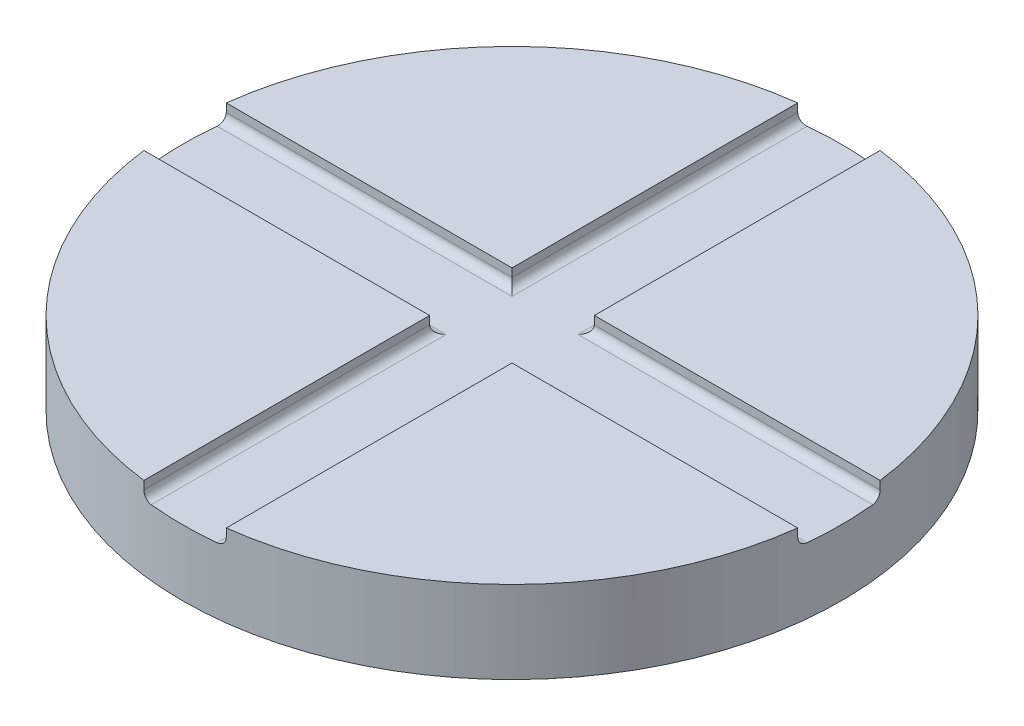
ISO-10303-21;
HEADER;
FILE_DESCRIPTION(('STEP AP214'),'2;1');
FILE_NAME('part.step','',(''),(''),'','','');
FILE_SCHEMA(('AUTOMOTIVE_DESIGN { 1 0 10303 214 1 1 1 1 }'));
ENDSEC;
DATA;
#1=APPLICATION_CONTEXT('core data for automotive mechanical design processes');
#2=APPLICATION_PROTOCOL_DEFINITION('international standard','automotive_design',2000,#1);
#3=PRODUCT_CONTEXT('',#1,'mechanical');
#4=PRODUCT('Part','Part','',(#3));
#5=PRODUCT_RELATED_PRODUCT_CATEGORY('part','',(#4));
#6=PRODUCT_DEFINITION_FORMATION('','',#4);
#7=PRODUCT_DEFINITION_CONTEXT('part definition',#1,'design');
#8=PRODUCT_DEFINITION('design','',#6,#7);
#9=PRODUCT_DEFINITION_SHAPE('','',#8);
#10=(LENGTH_UNIT() NAMED_UNIT(*) SI_UNIT(.MILLI.,.METRE.));
#11=(NAMED_UNIT(*) PLANE_ANGLE_UNIT() SI_UNIT($,.RADIAN.));
#12=(NAMED_UNIT(*) SI_UNIT($,.STERADIAN.) SOLID_ANGLE_UNIT());
#13=UNCERTAINTY_MEASURE_WITH_UNIT(LENGTH_MEASURE(1.E-05),#10,'distance_accuracy_value','');
#14=(GEOMETRIC_REPRESENTATION_CONTEXT(3) GLOBAL_UNCERTAINTY_ASSIGNED_CONTEXT((#13)) GLOBAL_UNIT_ASSIGNED_CONTEXT((#10,
#11,#12)) REPRESENTATION_CONTEXT('',''));
#15=CARTESIAN_POINT('',(0.,0.,0.));
#16=DIRECTION('',(0.,0.,1.));
#17=DIRECTION('',(1.,0.,0.));
#18=AXIS2_PLACEMENT_3D('',#15,#16,#17);
#19=CARTESIAN_POINT('',(0.,10.,0.));
#20=DIRECTION('',(0.,1.,0.));
#21=DIRECTION('',(0.,0.,1.));
#22=AXIS2_PLACEMENT_3D('',#19,#20,#21);
#23=PLANE('',#22);
#24=DIRECTION('',(0.,0.,-1.));
#25=VECTOR('',#24,1.);
#26=CARTESIAN_POINT('',(5.,10.,-4.99999999999998));
#27=LINE('',#26,#25);
#28=CARTESIAN_POINT('',(5.,10.,-4.99999999999998));
#29=VERTEX_POINT('',#28);
#30=CARTESIAN_POINT('',(4.99999999999999,10.,-39.6862696659689));
#31=VERTEX_POINT('',#30);
#32=EDGE_CURVE('E206',#29,#31,#27,.T.);
#33=ORIENTED_EDGE('',*,*,#32,.F.);
#34=DIRECTION('',(-1.,0.,0.));
#35=VECTOR('',#34,1.);
#36=CARTESIAN_POINT('',(39.6862696659689,10.,-4.99999999999987));
#37=LINE('',#36,#35);
#38=CARTESIAN_POINT('',(39.6862696659689,10.,-4.99999999999987));
#39=VERTEX_POINT('',#38);
#40=EDGE_CURVE('E203',#39,#29,#37,.T.);
#41=ORIENTED_EDGE('',*,*,#40,.F.);
#42=CARTESIAN_POINT('',(0.,10.,0.));
#43=DIRECTION('',(0.,1.,0.));
#44=DIRECTION('',(0.,0.,1.));
#45=AXIS2_PLACEMENT_3D('',#42,#43,#44);
#46=CIRCLE('',#45,40.);
#47=EDGE_CURVE('E236',#39,#31,#46,.T.);
#48=ORIENTED_EDGE('',*,*,#47,.T.);
#49=EDGE_LOOP('',(#33,#41,#48));
#50=FACE_BOUND('',#49,.T.);
#51=ADVANCED_FACE('F36',(#50),#23,.T.);
#52=DIRECTION('',(1.,0.,0.));
#53=VECTOR('',#52,1.);
#54=CARTESIAN_POINT('',(39.6862696659688,10.,5.00000000000014));
#55=LINE('',#54,#53);
#56=CARTESIAN_POINT('',(5.,10.,5.00000000000002));
#57=VERTEX_POINT('',#56);
#58=CARTESIAN_POINT('',(39.6862696659688,10.,5.00000000000014));
#59=VERTEX_POINT('',#58);
#60=EDGE_CURVE('E200',#57,#59,#55,.T.);
#61=ORIENTED_EDGE('',*,*,#60,.F.);
#62=DIRECTION('',(0.,0.,-1.));
#63=VECTOR('',#62,1.);
#64=CARTESIAN_POINT('',(5.00000000000001,10.,39.6862696659689));
#65=LINE('',#64,#63);
#66=CARTESIAN_POINT('',(5.,10.,39.6862696659689));
#67=VERTEX_POINT('',#66);
#68=EDGE_CURVE('E197',#67,#57,#65,.T.);
#69=ORIENTED_EDGE('',*,*,#68,.F.);
#70=EDGE_CURVE('E232',#67,#59,#46,.T.);
#71=ORIENTED_EDGE('',*,*,#70,.T.);
#72=EDGE_LOOP('',(#61,#69,#71));
#73=FACE_BOUND('',#72,.T.);
#74=ADVANCED_FACE('F404',(#73),#23,.T.);
#75=DIRECTION('',(0.,0.,1.));
#76=VECTOR('',#75,1.);
#77=CARTESIAN_POINT('',(-5.,10.,4.99999999999998));
#78=LINE('',#77,#76);
#79=CARTESIAN_POINT('',(-5.,10.,4.99999999999998));
#80=VERTEX_POINT('',#79);
#81=CARTESIAN_POINT('',(-4.99999999999999,10.,39.6862696659689));
#82=VERTEX_POINT('',#81);
#83=EDGE_CURVE('E191',#80,#82,#78,.T.);
#84=ORIENTED_EDGE('',*,*,#83,.F.);
#85=DIRECTION('',(1.,0.,0.));
#86=VECTOR('',#85,1.);
#87=CARTESIAN_POINT('',(-5.,10.,4.99999999999998));
#88=LINE('',#87,#86);
#89=CARTESIAN_POINT('',(-39.6862696659689,10.,4.99999999999987));
#90=VERTEX_POINT('',#89);
#91=EDGE_CURVE('E188',#90,#80,#88,.T.);
#92=ORIENTED_EDGE('',*,*,#91,.F.);
#93=EDGE_CURVE('E237',#90,#82,#46,.T.);
#94=ORIENTED_EDGE('',*,*,#93,.T.);
#95=EDGE_LOOP('',(#84,#92,#94));
#96=FACE_BOUND('',#95,.T.);
#97=ADVANCED_FACE('F390',(#96),#23,.T.);
#98=CARTESIAN_POINT('',(0.,10.,0.));
#99=DIRECTION('',(0.,-1.,0.));
#100=DIRECTION('',(0.,0.,-1.));
#101=AXIS2_PLACEMENT_3D('',#98,#99,#100);
#102=CYLINDRICAL_SURFACE('',#101,40.);
#103=ORIENTED_EDGE('',*,*,#47,.F.);
#104=DIRECTION('',(0.,1.,0.));
#105=VECTOR('',#104,1.);
#106=CARTESIAN_POINT('',(39.6862696659689,8.,-4.99999999999987));
#107=LINE('',#106,#105);
#108=CARTESIAN_POINT('',(39.6862696659689,9.,-4.99999999999987));
#109=VERTEX_POINT('',#108);
#110=EDGE_CURVE('E215',#109,#39,#107,.T.);
#111=ORIENTED_EDGE('',*,*,#110,.F.);
#112=CARTESIAN_POINT('',(39.6862696659689,9.,-4.99999999999987));
#113=CARTESIAN_POINT('',(39.6862695027617,8.97201614805015,-4.99999993357622));
#114=CARTESIAN_POINT('',(39.6864177702256,8.94404576899635,-4.99882461057146));
#115=CARTESIAN_POINT('',(39.6870080524468,8.88830659733769,-4.99413657089314));
#116=CARTESIAN_POINT('',(39.6874500476886,8.86053779146411,-4.99062400950667));
#117=CARTESIAN_POINT('',(39.6892097606616,8.77789450816225,-4.97661760935785));
#118=CARTESIAN_POINT('',(39.6909612306095,8.72357590735651,-4.96265493894818));
#119=CARTESIAN_POINT('',(39.6955413808402,8.61807727474457,-4.92588403902895));
#120=CARTESIAN_POINT('',(39.6983704812624,8.56689847611017,-4.9030723594642));
#121=CARTESIAN_POINT('',(39.7049782290013,8.46910438890421,-4.84927164903831));
#122=CARTESIAN_POINT('',(39.7087567793067,8.42248863477266,-4.8182834536085));
#123=CARTESIAN_POINT('',(39.7171157443231,8.33494426664107,-4.74888822091645));
#124=CARTESIAN_POINT('',(39.7216991764664,8.29403813162976,-4.71045320808411));
#125=CARTESIAN_POINT('',(39.7314684915845,8.21923965956769,-4.6273274442715));
#126=CARTESIAN_POINT('',(39.7366545046203,8.18534884110995,-4.5826353423329));
#127=CARTESIAN_POINT('',(39.7474634774549,8.12529929208209,-4.48792079805385));
#128=CARTESIAN_POINT('',(39.7530893272866,8.09919828142031,-4.4378621277093));
#129=CARTESIAN_POINT('',(39.7645355120032,8.05578879586342,-4.33410116069595));
#130=CARTESIAN_POINT('',(39.7703557434709,8.03847572249148,-4.28040078633851));
#131=CARTESIAN_POINT('',(39.780100619057,8.01722504646947,-4.1886728927391));
#132=CARTESIAN_POINT('',(39.7840280196568,8.01077075633196,-4.15120899434081));
#133=CARTESIAN_POINT('',(39.7918207835748,8.002158516583,-4.07583708584562));
#134=CARTESIAN_POINT('',(39.7956862246759,7.99999467947822,-4.03792975623872));
#135=CARTESIAN_POINT('',(39.7994974842648,8.,-3.99999999999987));
#136=B_SPLINE_CURVE_WITH_KNOTS('',3,(#112,#113,#114,#115,#116,#117,#118,#119,#120,#121,#122,
#123,#124,#125,#126,#127,#128,#129,#130,#131,#132,#133,#134,#135),.UNSPECIFIED.,.F.,.F.,(4,2,2,
2,2,2,2,2,2,2,2,4),(0.,0.083899766016086,0.167793958253706,0.335264682446551,0.502800765922254,
0.670319738108458,0.838480680454716,1.00667798632015,1.1760922862204,1.34541784482606,
1.45984320910194,1.57411144635977),.UNSPECIFIED.);
#137=CARTESIAN_POINT('',(39.7994974842648,8.,-3.99999999999987));
#138=VERTEX_POINT('',#137);
#139=EDGE_CURVE('E273',#109,#138,#136,.T.);
#140=ORIENTED_EDGE('',*,*,#139,.T.);
#141=CARTESIAN_POINT('',(0.,8.,0.));
#142=DIRECTION('',(0.,1.,0.));
#143=DIRECTION('',(0.,0.,1.));
#144=AXIS2_PLACEMENT_3D('',#141,#142,#143);
#145=CIRCLE('',#144,40.);
#146=CARTESIAN_POINT('',(39.7994974842648,8.,4.00000000000014));
#147=VERTEX_POINT('',#146);
#148=EDGE_CURVE('E231',#147,#138,#145,.T.);
#149=ORIENTED_EDGE('',*,*,#148,.F.);
#150=CARTESIAN_POINT('',(39.7994974842648,8.,4.00000000000014));
#151=CARTESIAN_POINT('',(39.7966554556297,8.00000025906885,4.02827952259479));
#152=CARTESIAN_POINT('',(39.7937842809307,8.00120033334521,4.05654234163021));
#153=CARTESIAN_POINT('',(39.7880030195228,8.00598684529,4.1128597212859));
#154=CARTESIAN_POINT('',(39.7850929347491,8.00957316470635,4.14091429215638));
#155=CARTESIAN_POINT('',(39.7763420245949,8.02387694577551,4.22442104199039));
#156=CARTESIAN_POINT('',(39.7704715961916,8.03813932454347,4.2793051724809));
#157=CARTESIAN_POINT('',(39.7588586689261,8.07572339633123,4.3858911663662));
#158=CARTESIAN_POINT('',(39.753116232053,8.09904938240363,4.43759150826935));
#159=CARTESIAN_POINT('',(39.7419688364526,8.15410859124359,4.53634018125088));
#160=CARTESIAN_POINT('',(39.736563814167,8.18584022471381,4.5833893894353));
#161=CARTESIAN_POINT('',(39.7263092861631,8.25678619156755,4.67143630491196));
#162=CARTESIAN_POINT('',(39.7214591374397,8.29599172049722,4.7124410329743));
#163=CARTESIAN_POINT('',(39.7125083888989,8.38082253610512,4.78728543816298));
#164=CARTESIAN_POINT('',(39.7084079219226,8.4264489580143,4.82112384560897));
#165=CARTESIAN_POINT('',(39.7011580380095,8.52255432967826,4.88046540788574));
#166=CARTESIAN_POINT('',(39.698003612503,8.57300578970437,4.9060125201632));
#167=CARTESIAN_POINT('',(39.6927608676376,8.67752392075445,4.94825129371904));
#168=CARTESIAN_POINT('',(39.6906718118812,8.7315880653283,4.96494907208755));
#169=CARTESIAN_POINT('',(39.688204095243,8.82168291633538,4.98462780684713));
#170=CARTESIAN_POINT('',(39.6874797043065,8.85712147200953,4.99038878592633));
#171=CARTESIAN_POINT('',(39.6865122964614,8.928368096716,4.99807425711897));
#172=CARTESIAN_POINT('',(39.6862686041934,8.96417557617632,5.00000413178172));
#173=CARTESIAN_POINT('',(39.6862696659688,9.,5.00000000000014));
#174=B_SPLINE_CURVE_WITH_KNOTS('',3,(#150,#151,#152,#153,#154,#155,#156,#157,#158,#159,#160,
#161,#162,#163,#164,#165,#166,#167,#168,#169,#170,#171,#172,#173),.UNSPECIFIED.,.F.,.F.,(4,2,2,
2,2,2,2,2,2,2,2,4),(0.,0.0852134051745159,0.170422587852374,0.340576272794492,0.510810650875915,
0.681012864846754,0.851015801292158,1.02104883255947,1.19016509753946,1.35916430814808,
1.46670301389425,1.57409052480431),.UNSPECIFIED.);
#175=CARTESIAN_POINT('',(39.6862696659688,9.,5.00000000000014));
#176=VERTEX_POINT('',#175);
#177=EDGE_CURVE('E280',#147,#176,#174,.T.);
#178=ORIENTED_EDGE('',*,*,#177,.T.);
#179=DIRECTION('',(0.,1.,0.));
#180=VECTOR('',#179,1.);
#181=CARTESIAN_POINT('',(39.6862696659688,8.,5.00000000000014));
#182=LINE('',#181,#180);
#183=EDGE_CURVE('E217',#176,#59,#182,.T.);
#184=ORIENTED_EDGE('',*,*,#183,.T.);
#185=ORIENTED_EDGE('',*,*,#70,.F.);
#186=DIRECTION('',(0.,1.,0.));
#187=VECTOR('',#186,1.);
#188=CARTESIAN_POINT('',(5.,8.,39.6862696659689));
#189=LINE('',#188,#187);
#190=CARTESIAN_POINT('',(5.,9.,39.6862696659689));
#191=VERTEX_POINT('',#190);
#192=EDGE_CURVE('E221',#191,#67,#189,.T.);
#193=ORIENTED_EDGE('',*,*,#192,.F.);
#194=CARTESIAN_POINT('',(5.00000000000001,9.,39.6862696659689));
#195=CARTESIAN_POINT('',(4.99999993357637,8.97201614805015,39.6862695027617));
#196=CARTESIAN_POINT('',(4.9988246105716,8.94404576899635,39.6864177702256));
#197=CARTESIAN_POINT('',(4.99413657089329,8.88830659733769,39.6870080524468));
#198=CARTESIAN_POINT('',(4.99062400950681,8.86053779146411,39.6874500476886));
#199=CARTESIAN_POINT('',(4.97661760935799,8.77789450816224,39.6892097606616));
#200=CARTESIAN_POINT('',(4.96265493894833,8.72357590735651,39.6909612306094));
#201=CARTESIAN_POINT('',(4.9258840390291,8.61807727474457,39.6955413808402));
#202=CARTESIAN_POINT('',(4.90307235946434,8.56689847611017,39.6983704812624));
#203=CARTESIAN_POINT('',(4.84927164903845,8.46910438890421,39.7049782290013));
#204=CARTESIAN_POINT('',(4.81828345360864,8.42248863477266,39.7087567793066));
#205=CARTESIAN_POINT('',(4.7488882209166,8.33494426664106,39.7171157443231));
#206=CARTESIAN_POINT('',(4.71045320808425,8.29403813162976,39.7216991764664));
#207=CARTESIAN_POINT('',(4.62732744427165,8.21923965956769,39.7314684915845));
#208=CARTESIAN_POINT('',(4.58263534233305,8.18534884110995,39.7366545046203));
#209=CARTESIAN_POINT('',(4.487920798054,8.12529929208209,39.7474634774549));
#210=CARTESIAN_POINT('',(4.43786212770944,8.09919828142031,39.7530893272866));
#211=CARTESIAN_POINT('',(4.33410116069609,8.05578879586342,39.7645355120032));
#212=CARTESIAN_POINT('',(4.28040078633866,8.03847572249148,39.7703557434709));
#213=CARTESIAN_POINT('',(4.18867289273924,8.01722504646947,39.780100619057));
#214=CARTESIAN_POINT('',(4.15120899434096,8.01077075633196,39.7840280196568));
#215=CARTESIAN_POINT('',(4.07583708584577,8.002158516583,39.7918207835747));
#216=CARTESIAN_POINT('',(4.03792975623887,7.99999467947822,39.7956862246759));
#217=CARTESIAN_POINT('',(4.00000000000002,8.,39.7994974842648));
#218=B_SPLINE_CURVE_WITH_KNOTS('',3,(#194,#195,#196,#197,#198,#199,#200,#201,#202,#203,#204,
#205,#206,#207,#208,#209,#210,#211,#212,#213,#214,#215,#216,#217),.UNSPECIFIED.,.F.,.F.,(4,2,2,
2,2,2,2,2,2,2,2,4),(0.,0.0838997660160859,0.167793958253708,0.335264682446551,0.502800765922254,
0.670319738108457,0.838480680454718,1.00667798632015,1.1760922862204,1.34541784482606,
1.45984320910194,1.57411144635977),.UNSPECIFIED.);
#219=CARTESIAN_POINT('',(4.00000000000001,8.,39.7994974842648));
#220=VERTEX_POINT('',#219);
#221=EDGE_CURVE('E310',#191,#220,#218,.T.);
#222=ORIENTED_EDGE('',*,*,#221,.T.);
#223=CARTESIAN_POINT('',(0.,8.,0.));
#224=DIRECTION('',(0.,1.,0.));
#225=DIRECTION('',(0.,0.,1.));
#226=AXIS2_PLACEMENT_3D('',#223,#224,#225);
#227=CIRCLE('',#226,40.);
#228=CARTESIAN_POINT('',(-3.99999999999999,8.,39.7994974842648));
#229=VERTEX_POINT('',#228);
#230=EDGE_CURVE('E364',#229,#220,#227,.T.);
#231=ORIENTED_EDGE('',*,*,#230,.F.);
#232=CARTESIAN_POINT('',(-3.99999999999999,8.,39.7994974842648));
#233=CARTESIAN_POINT('',(-4.02827952259464,8.00000025906885,39.7966554556297));
#234=CARTESIAN_POINT('',(-4.05654234163006,8.00120033334521,39.7937842809307));
#235=CARTESIAN_POINT('',(-4.11285972128575,8.00598684529,39.7880030195228));
#236=CARTESIAN_POINT('',(-4.14091429215623,8.00957316470635,39.7850929347492));
#237=CARTESIAN_POINT('',(-4.22442104199024,8.02387694577551,39.7763420245949));
#238=CARTESIAN_POINT('',(-4.27930517248075,8.03813932454347,39.7704715961917));
#239=CARTESIAN_POINT('',(-4.38589116636605,8.07572339633123,39.7588586689262));
#240=CARTESIAN_POINT('',(-4.43759150826921,8.09904938240363,39.753116232053));
#241=CARTESIAN_POINT('',(-4.53634018125073,8.15410859124359,39.7419688364526));
#242=CARTESIAN_POINT('',(-4.58338938943514,8.18584022471381,39.736563814167));
#243=CARTESIAN_POINT('',(-4.67143630491181,8.25678619156754,39.7263092861631));
#244=CARTESIAN_POINT('',(-4.71244103297415,8.29599172049722,39.7214591374397));
#245=CARTESIAN_POINT('',(-4.78728543816283,8.38082253610511,39.7125083888989));
#246=CARTESIAN_POINT('',(-4.82112384560882,8.4264489580143,39.7084079219226));
#247=CARTESIAN_POINT('',(-4.8804654078856,8.52255432967826,39.7011580380096));
#248=CARTESIAN_POINT('',(-4.90601252016305,8.57300578970437,39.698003612503));
#249=CARTESIAN_POINT('',(-4.94825129371889,8.67752392075445,39.6927608676376));
#250=CARTESIAN_POINT('',(-4.9649490720874,8.7315880653283,39.6906718118812));
#251=CARTESIAN_POINT('',(-4.98462780684698,8.82168291633538,39.688204095243));
#252=CARTESIAN_POINT('',(-4.99038878592618,8.85712147200953,39.6874797043065));
#253=CARTESIAN_POINT('',(-4.99807425711882,8.928368096716,39.6865122964614));
#254=CARTESIAN_POINT('',(-5.00000413178157,8.96417557617632,39.6862686041934));
#255=CARTESIAN_POINT('',(-4.99999999999999,9.,39.6862696659689));
#256=B_SPLINE_CURVE_WITH_KNOTS('',3,(#232,#233,#234,#235,#236,#237,#238,#239,#240,#241,#242,
#243,#244,#245,#246,#247,#248,#249,#250,#251,#252,#253,#254,#255),.UNSPECIFIED.,.F.,.F.,(4,2,2,
2,2,2,2,2,2,2,2,4),(0.,0.0852134051745151,0.170422587852372,0.340576272794492,0.510810650875913,
0.681012864846751,0.851015801292156,1.02104883255947,1.19016509753946,1.35916430814808,
1.46670301389425,1.57409052480431),.UNSPECIFIED.);
#257=CARTESIAN_POINT('',(-4.99999999999999,9.,39.6862696659689));
#258=VERTEX_POINT('',#257);
#259=EDGE_CURVE('E11',#229,#258,#256,.T.);
#260=ORIENTED_EDGE('',*,*,#259,.T.);
#261=DIRECTION('',(0.,1.,0.));
#262=VECTOR('',#261,1.);
#263=CARTESIAN_POINT('',(-4.99999999999999,8.,39.6862696659689));
#264=LINE('',#263,#262);
#265=EDGE_CURVE('E223',#258,#82,#264,.T.);
#266=ORIENTED_EDGE('',*,*,#265,.T.);
#267=ORIENTED_EDGE('',*,*,#93,.F.);
#268=DIRECTION('',(0.,1.,0.));
#269=VECTOR('',#268,1.);
#270=CARTESIAN_POINT('',(-39.6862696659689,8.,4.99999999999987));
#271=LINE('',#270,#269);
#272=CARTESIAN_POINT('',(-39.6862696659689,9.,4.99999999999987));
#273=VERTEX_POINT('',#272);
#274=EDGE_CURVE('E227',#273,#90,#271,.T.);
#275=ORIENTED_EDGE('',*,*,#274,.F.);
#276=CARTESIAN_POINT('',(-39.6862696659689,9.,4.99999999999986));
#277=CARTESIAN_POINT('',(-39.6862695027617,8.97201614805015,4.99999993357622));
#278=CARTESIAN_POINT('',(-39.6864177702256,8.94404576899635,4.99882461057145));
#279=CARTESIAN_POINT('',(-39.6870080524468,8.88830659733769,4.99413657089314));
#280=CARTESIAN_POINT('',(-39.6874500476886,8.86053779146411,4.99062400950666));
#281=CARTESIAN_POINT('',(-39.6892097606616,8.77789450816225,4.97661760935784));
#282=CARTESIAN_POINT('',(-39.6909612306095,8.72357590735651,4.96265493894818));
#283=CARTESIAN_POINT('',(-39.6955413808402,8.61807727474457,4.92588403902895));
#284=CARTESIAN_POINT('',(-39.6983704812624,8.56689847611017,4.90307235946419));
#285=CARTESIAN_POINT('',(-39.7049782290013,8.46910438890421,4.8492716490383));
#286=CARTESIAN_POINT('',(-39.7087567793067,8.42248863477266,4.81828345360849));
#287=CARTESIAN_POINT('',(-39.7171157443231,8.33494426664107,4.74888822091645));
#288=CARTESIAN_POINT('',(-39.7216991764664,8.29403813162976,4.71045320808411));
#289=CARTESIAN_POINT('',(-39.7314684915845,8.21923965956769,4.6273274442715));
#290=CARTESIAN_POINT('',(-39.7366545046203,8.18534884110995,4.5826353423329));
#291=CARTESIAN_POINT('',(-39.7474634774549,8.12529929208209,4.48792079805385));
#292=CARTESIAN_POINT('',(-39.7530893272866,8.09919828142031,4.4378621277093));
#293=CARTESIAN_POINT('',(-39.7645355120032,8.05578879586342,4.33410116069594));
#294=CARTESIAN_POINT('',(-39.7703557434709,8.03847572249148,4.28040078633851));
#295=CARTESIAN_POINT('',(-39.780100619057,8.01722504646947,4.18867289273909));
#296=CARTESIAN_POINT('',(-39.7840280196568,8.01077075633196,4.15120899434081));
#297=CARTESIAN_POINT('',(-39.7918207835748,8.002158516583,4.07583708584562));
#298=CARTESIAN_POINT('',(-39.7956862246759,7.99999467947822,4.03792975623872));
#299=CARTESIAN_POINT('',(-39.7994974842648,8.,3.99999999999986));
#300=B_SPLINE_CURVE_WITH_KNOTS('',3,(#276,#277,#278,#279,#280,#281,#282,#283,#284,#285,#286,
#287,#288,#289,#290,#291,#292,#293,#294,#295,#296,#297,#298,#299),.UNSPECIFIED.,.F.,.F.,(4,2,2,
2,2,2,2,2,2,2,2,4),(0.,0.083899766016086,0.167793958253706,0.335264682446551,0.502800765922254,
0.670319738108457,0.838480680454714,1.00667798632014,1.1760922862204,1.34541784482606,
1.45984320910194,1.57411144635977),.UNSPECIFIED.);
#301=CARTESIAN_POINT('',(-39.7994974842648,8.,3.99999999999986));
#302=VERTEX_POINT('',#301);
#303=EDGE_CURVE('E46',#273,#302,#300,.T.);
#304=ORIENTED_EDGE('',*,*,#303,.T.);
#305=CARTESIAN_POINT('',(0.,8.,0.));
#306=DIRECTION('',(0.,1.,0.));
#307=DIRECTION('',(0.,0.,-1.));
#308=AXIS2_PLACEMENT_3D('',#305,#306,#307);
#309=CIRCLE('',#308,40.);
#310=CARTESIAN_POINT('',(-39.7994974842648,8.,-4.00000000000013));
#311=VERTEX_POINT('',#310);
#312=EDGE_CURVE('E362',#311,#302,#309,.T.);
#313=ORIENTED_EDGE('',*,*,#312,.F.);
#314=CARTESIAN_POINT('',(-39.7994974842648,8.,-4.00000000000013));
#315=CARTESIAN_POINT('',(-39.7966554556297,8.00000025906885,-4.02827952259479));
#316=CARTESIAN_POINT('',(-39.7937842809307,8.00120033334521,-4.05654234163021));
#317=CARTESIAN_POINT('',(-39.7880030195228,8.00598684529,-4.11285972128589));
#318=CARTESIAN_POINT('',(-39.7850929347491,8.00957316470635,-4.14091429215638));
#319=CARTESIAN_POINT('',(-39.7763420245948,8.02387694577551,-4.22442104199039));
#320=CARTESIAN_POINT('',(-39.7704715961916,8.03813932454347,-4.27930517248089));
#321=CARTESIAN_POINT('',(-39.7588586689261,8.07572339633123,-4.3858911663662));
#322=CARTESIAN_POINT('',(-39.753116232053,8.09904938240363,-4.43759150826935));
#323=CARTESIAN_POINT('',(-39.7419688364526,8.15410859124359,-4.53634018125087));
#324=CARTESIAN_POINT('',(-39.736563814167,8.18584022471381,-4.58338938943529));
#325=CARTESIAN_POINT('',(-39.7263092861631,8.25678619156754,-4.67143630491195));
#326=CARTESIAN_POINT('',(-39.7214591374397,8.29599172049722,-4.7124410329743));
#327=CARTESIAN_POINT('',(-39.7125083888989,8.38082253610511,-4.78728543816297));
#328=CARTESIAN_POINT('',(-39.7084079219226,8.4264489580143,-4.82112384560896));
#329=CARTESIAN_POINT('',(-39.7011580380095,8.52255432967826,-4.88046540788574));
#330=CARTESIAN_POINT('',(-39.698003612503,8.57300578970437,-4.9060125201632));
#331=CARTESIAN_POINT('',(-39.6927608676376,8.67752392075445,-4.94825129371904));
#332=CARTESIAN_POINT('',(-39.6906718118812,8.7315880653283,-4.96494907208754));
#333=CARTESIAN_POINT('',(-39.688204095243,8.82168291633537,-4.98462780684713));
#334=CARTESIAN_POINT('',(-39.6874797043065,8.85712147200953,-4.99038878592633));
#335=CARTESIAN_POINT('',(-39.6865122964614,8.928368096716,-4.99807425711897));
#336=CARTESIAN_POINT('',(-39.6862686041934,8.96417557617632,-5.00000413178172));
#337=CARTESIAN_POINT('',(-39.6862696659688,9.,-5.00000000000014));
#338=B_SPLINE_CURVE_WITH_KNOTS('',3,(#314,#315,#316,#317,#318,#319,#320,#321,#322,#323,#324,
#325,#326,#327,#328,#329,#330,#331,#332,#333,#334,#335,#336,#337),.UNSPECIFIED.,.F.,.F.,(4,2,2,
2,2,2,2,2,2,2,2,4),(0.,0.0852134051745153,0.170422587852373,0.340576272794492,0.510810650875914,
0.681012864846752,0.851015801292156,1.02104883255946,1.19016509753946,1.35916430814808,
1.46670301389425,1.57409052480431),.UNSPECIFIED.);
#339=CARTESIAN_POINT('',(-39.6862696659688,9.,-5.00000000000013));
#340=VERTEX_POINT('',#339);
#341=EDGE_CURVE('E319',#311,#340,#338,.T.);
#342=ORIENTED_EDGE('',*,*,#341,.T.);
#343=DIRECTION('',(0.,1.,0.));
#344=VECTOR('',#343,1.);
#345=CARTESIAN_POINT('',(-39.6862696659688,8.,-5.00000000000013));
#346=LINE('',#345,#344);
#347=CARTESIAN_POINT('',(-39.6862696659688,10.,-5.00000000000013));
#348=VERTEX_POINT('',#347);
#349=EDGE_CURVE('E175',#340,#348,#346,.T.);
#350=ORIENTED_EDGE('',*,*,#349,.T.);
#351=CARTESIAN_POINT('',(-5.00000000000002,10.,-39.6862696659689));
#352=VERTEX_POINT('',#351);
#353=EDGE_CURVE('E187',#352,#348,#46,.T.);
#354=ORIENTED_EDGE('',*,*,#353,.F.);
#355=DIRECTION('',(0.,1.,0.));
#356=VECTOR('',#355,1.);
#357=CARTESIAN_POINT('',(-5.00000000000002,8.,-39.6862696659689));
#358=LINE('',#357,#356);
#359=CARTESIAN_POINT('',(-5.00000000000002,9.,-39.6862696659689));
#360=VERTEX_POINT('',#359);
#361=EDGE_CURVE('E176',#360,#352,#358,.T.);
#362=ORIENTED_EDGE('',*,*,#361,.F.);
#363=CARTESIAN_POINT('',(-5.00000000000002,9.,-39.6862696659689));
#364=CARTESIAN_POINT('',(-4.99999993357637,8.97201614805015,-39.6862695027617));
#365=CARTESIAN_POINT('',(-4.99882461057161,8.94404576899635,-39.6864177702256));
#366=CARTESIAN_POINT('',(-4.99413657089329,8.88830659733769,-39.6870080524468));
#367=CARTESIAN_POINT('',(-4.99062400950682,8.86053779146411,-39.6874500476886));
#368=CARTESIAN_POINT('',(-4.976617609358,8.77789450816224,-39.6892097606616));
#369=CARTESIAN_POINT('',(-4.96265493894833,8.72357590735651,-39.6909612306094));
#370=CARTESIAN_POINT('',(-4.9258840390291,8.61807727474457,-39.6955413808402));
#371=CARTESIAN_POINT('',(-4.90307235946435,8.56689847611017,-39.6983704812624));
#372=CARTESIAN_POINT('',(-4.84927164903846,8.46910438890421,-39.7049782290013));
#373=CARTESIAN_POINT('',(-4.81828345360865,8.42248863477266,-39.7087567793066));
#374=CARTESIAN_POINT('',(-4.7488882209166,8.33494426664106,-39.7171157443231));
#375=CARTESIAN_POINT('',(-4.71045320808426,8.29403813162976,-39.7216991764664));
#376=CARTESIAN_POINT('',(-4.62732744427165,8.21923965956769,-39.7314684915845));
#377=CARTESIAN_POINT('',(-4.58263534233305,8.18534884110995,-39.7366545046203));
#378=CARTESIAN_POINT('',(-4.487920798054,8.12529929208209,-39.7474634774549));
#379=CARTESIAN_POINT('',(-4.43786212770945,8.09919828142031,-39.7530893272866));
#380=CARTESIAN_POINT('',(-4.3341011606961,8.05578879586342,-39.7645355120032));
#381=CARTESIAN_POINT('',(-4.28040078633866,8.03847572249148,-39.7703557434709));
#382=CARTESIAN_POINT('',(-4.18867289273925,8.01722504646947,-39.780100619057));
#383=CARTESIAN_POINT('',(-4.15120899434096,8.01077075633196,-39.7840280196568));
#384=CARTESIAN_POINT('',(-4.07583708584577,8.002158516583,-39.7918207835747));
#385=CARTESIAN_POINT('',(-4.03792975623887,7.99999467947822,-39.7956862246759));
#386=CARTESIAN_POINT('',(-4.00000000000002,8.,-39.7994974842648));
#387=B_SPLINE_CURVE_WITH_KNOTS('',3,(#363,#364,#365,#366,#367,#368,#369,#370,#371,#372,#373,
#374,#375,#376,#377,#378,#379,#380,#381,#382,#383,#384,#385,#386),.UNSPECIFIED.,.F.,.F.,(4,2,2,
2,2,2,2,2,2,2,2,4),(0.,0.0838997660160859,0.167793958253707,0.335264682446551,0.502800765922254,
0.670319738108458,0.838480680454718,1.00667798632015,1.1760922862204,1.34541784482606,
1.45984320910194,1.57411144635977),.UNSPECIFIED.);
#388=CARTESIAN_POINT('',(-4.00000000000002,8.,-39.7994974842648));
#389=VERTEX_POINT('',#388);
#390=EDGE_CURVE('E309',#360,#389,#387,.T.);
#391=ORIENTED_EDGE('',*,*,#390,.T.);
#392=CARTESIAN_POINT('',(0.,8.,0.));
#393=DIRECTION('',(0.,1.,0.));
#394=DIRECTION('',(0.,0.,1.));
#395=AXIS2_PLACEMENT_3D('',#392,#393,#394);
#396=CIRCLE('',#395,40.);
#397=CARTESIAN_POINT('',(3.99999999999999,8.,-39.7994974842648));
#398=VERTEX_POINT('',#397);
#399=EDGE_CURVE('E209',#398,#389,#396,.T.);
#400=ORIENTED_EDGE('',*,*,#399,.F.);
#401=CARTESIAN_POINT('',(3.99999999999999,8.,-39.7994974842648));
#402=CARTESIAN_POINT('',(4.02827952259464,8.00000025906885,-39.7966554556297));
#403=CARTESIAN_POINT('',(4.05654234163006,8.00120033334521,-39.7937842809307));
#404=CARTESIAN_POINT('',(4.11285972128574,8.00598684529,-39.7880030195228));
#405=CARTESIAN_POINT('',(4.14091429215623,8.00957316470635,-39.7850929347492));
#406=CARTESIAN_POINT('',(4.22442104199024,8.02387694577551,-39.7763420245949));
#407=CARTESIAN_POINT('',(4.27930517248074,8.03813932454347,-39.7704715961917));
#408=CARTESIAN_POINT('',(4.38589116636605,8.07572339633123,-39.7588586689262));
#409=CARTESIAN_POINT('',(4.4375915082692,8.09904938240363,-39.753116232053));
#410=CARTESIAN_POINT('',(4.53634018125073,8.15410859124359,-39.7419688364526));
#411=CARTESIAN_POINT('',(4.58338938943514,8.1858402247138,-39.736563814167));
#412=CARTESIAN_POINT('',(4.6714363049118,8.25678619156755,-39.7263092861631));
#413=CARTESIAN_POINT('',(4.71244103297415,8.29599172049722,-39.7214591374397));
#414=CARTESIAN_POINT('',(4.78728543816282,8.38082253610511,-39.7125083888989));
#415=CARTESIAN_POINT('',(4.82112384560881,8.4264489580143,-39.7084079219226));
#416=CARTESIAN_POINT('',(4.88046540788559,8.52255432967826,-39.7011580380096));
#417=CARTESIAN_POINT('',(4.90601252016305,8.57300578970437,-39.698003612503));
#418=CARTESIAN_POINT('',(4.94825129371889,8.67752392075445,-39.6927608676376));
#419=CARTESIAN_POINT('',(4.9649490720874,8.7315880653283,-39.6906718118812));
#420=CARTESIAN_POINT('',(4.98462780684698,8.82168291633538,-39.688204095243));
#421=CARTESIAN_POINT('',(4.99038878592618,8.85712147200953,-39.6874797043065));
#422=CARTESIAN_POINT('',(4.99807425711882,8.928368096716,-39.6865122964614));
#423=CARTESIAN_POINT('',(5.00000413178157,8.96417557617632,-39.6862686041934));
#424=CARTESIAN_POINT('',(4.99999999999999,9.,-39.6862696659689));
#425=B_SPLINE_CURVE_WITH_KNOTS('',3,(#401,#402,#403,#404,#405,#406,#407,#408,#409,#410,#411,
#412,#413,#414,#415,#416,#417,#418,#419,#420,#421,#422,#423,#424),.UNSPECIFIED.,.F.,.F.,(4,2,2,
2,2,2,2,2,2,2,2,4),(0.,0.0852134051745158,0.170422587852372,0.340576272794492,0.510810650875913,
0.681012864846752,0.851015801292157,1.02104883255947,1.19016509753946,1.35916430814808,
1.46670301389425,1.57409052480431),.UNSPECIFIED.);
#426=CARTESIAN_POINT('',(4.99999999999999,9.,-39.6862696659689));
#427=VERTEX_POINT('',#426);
#428=EDGE_CURVE('E304',#398,#427,#425,.T.);
#429=ORIENTED_EDGE('',*,*,#428,.T.);
#430=DIRECTION('',(0.,1.,0.));
#431=VECTOR('',#430,1.);
#432=CARTESIAN_POINT('',(4.99999999999999,8.,-39.6862696659689));
#433=LINE('',#432,#431);
#434=EDGE_CURVE('E210',#427,#31,#433,.T.);
#435=ORIENTED_EDGE('',*,*,#434,.T.);
#436=EDGE_LOOP('',(#103,#111,#140,#149,#178,#184,#185,#193,#222,#231,#260,#266,#267,#275,#304,
#313,#342,#350,#354,#362,#391,#400,#429,#435));
#437=FACE_BOUND('',#436,.T.);
#438=CARTESIAN_POINT('',(0.,0.,0.));
#439=DIRECTION('',(0.,1.,0.));
#440=DIRECTION('',(0.,0.,1.));
#441=AXIS2_PLACEMENT_3D('',#438,#439,#440);
#442=CIRCLE('',#441,40.);
#443=CARTESIAN_POINT('',(0.,0.,40.));
#444=VERTEX_POINT('',#443);
#445=EDGE_CURVE('E212',#444,#444,#442,.T.);
#446=ORIENTED_EDGE('',*,*,#445,.T.);
#447=EDGE_LOOP('',(#446));
#448=FACE_BOUND('',#447,.T.);
#449=ADVANCED_FACE('F286',(#437,#448),#102,.T.);
#450=DIRECTION('',(-1.,0.,0.));
#451=VECTOR('',#450,1.);
#452=CARTESIAN_POINT('',(-5.,10.,-5.00000000000002));
#453=LINE('',#452,#451);
#454=CARTESIAN_POINT('',(-5.,10.,-5.00000000000002));
#455=VERTEX_POINT('',#454);
#456=EDGE_CURVE('E169',#455,#348,#453,.T.);
#457=ORIENTED_EDGE('',*,*,#456,.F.);
#458=DIRECTION('',(0.,0.,1.));
#459=VECTOR('',#458,1.);
#460=CARTESIAN_POINT('',(-5.00000000000002,10.,-39.6862696659689));
#461=LINE('',#460,#459);
#462=EDGE_CURVE('E179',#352,#455,#461,.T.);
#463=ORIENTED_EDGE('',*,*,#462,.F.);
#464=ORIENTED_EDGE('',*,*,#353,.T.);
#465=EDGE_LOOP('',(#457,#463,#464));
#466=FACE_BOUND('',#465,.T.);
#467=ADVANCED_FACE('F186',(#466),#23,.T.);
#468=CARTESIAN_POINT('',(0.,0.,0.));
#469=DIRECTION('',(0.,1.,0.));
#470=DIRECTION('',(0.,0.,1.));
#471=AXIS2_PLACEMENT_3D('',#468,#469,#470);
#472=PLANE('',#471);
#473=ORIENTED_EDGE('',*,*,#445,.F.);
#474=EDGE_LOOP('',(#473));
#475=FACE_BOUND('',#474,.T.);
#476=ADVANCED_FACE('F414',(#475),#472,.F.);
#477=CARTESIAN_POINT('',(5.,8.,-4.99999999999998));
#478=DIRECTION('',(1.,0.,0.));
#479=DIRECTION('',(0.,0.,-1.));
#480=AXIS2_PLACEMENT_3D('',#477,#478,#479);
#481=PLANE('',#480);
#482=ORIENTED_EDGE('',*,*,#434,.F.);
#483=DIRECTION('',(0.,0.,-1.));
#484=VECTOR('',#483,1.);
#485=CARTESIAN_POINT('',(5.,9.,-4.99999999999998));
#486=LINE('',#485,#484);
#487=CARTESIAN_POINT('',(5.,9.,-4.99999999999998));
#488=VERTEX_POINT('',#487);
#489=EDGE_CURVE('E265',#427,#488,#486,.F.);
#490=ORIENTED_EDGE('',*,*,#489,.T.);
#491=DIRECTION('',(0.,1.,0.));
#492=VECTOR('',#491,1.);
#493=CARTESIAN_POINT('',(5.,8.,-4.99999999999998));
#494=LINE('',#493,#492);
#495=EDGE_CURVE('E213',#488,#29,#494,.T.);
#496=ORIENTED_EDGE('',*,*,#495,.T.);
#497=ORIENTED_EDGE('',*,*,#32,.T.);
#498=EDGE_LOOP('',(#482,#490,#496,#497));
#499=FACE_BOUND('',#498,.T.);
#500=ADVANCED_FACE('F419',(#499),#481,.F.);
#501=CARTESIAN_POINT('',(39.6862696659689,8.,-4.99999999999987));
#502=DIRECTION('',(0.,0.,-1.));
#503=DIRECTION('',(-1.,0.,0.));
#504=AXIS2_PLACEMENT_3D('',#501,#502,#503);
#505=PLANE('',#504);
#506=ORIENTED_EDGE('',*,*,#495,.F.);
#507=DIRECTION('',(-1.,0.,0.));
#508=VECTOR('',#507,1.);
#509=CARTESIAN_POINT('',(39.6862696659689,9.,-4.99999999999987));
#510=LINE('',#509,#508);
#511=EDGE_CURVE('E259',#488,#109,#510,.F.);
#512=ORIENTED_EDGE('',*,*,#511,.T.);
#513=ORIENTED_EDGE('',*,*,#110,.T.);
#514=ORIENTED_EDGE('',*,*,#40,.T.);
#515=EDGE_LOOP('',(#506,#512,#513,#514));
#516=FACE_BOUND('',#515,.T.);
#517=ADVANCED_FACE('F441',(#516),#505,.F.);
#518=CARTESIAN_POINT('',(39.6862696659688,8.,5.00000000000014));
#519=DIRECTION('',(0.,0.,1.));
#520=DIRECTION('',(1.,0.,0.));
#521=AXIS2_PLACEMENT_3D('',#518,#519,#520);
#522=PLANE('',#521);
#523=ORIENTED_EDGE('',*,*,#183,.F.);
#524=DIRECTION('',(1.,0.,0.));
#525=VECTOR('',#524,1.);
#526=CARTESIAN_POINT('',(39.6862696659688,9.,5.00000000000014));
#527=LINE('',#526,#525);
#528=CARTESIAN_POINT('',(5.,9.,5.00000000000002));
#529=VERTEX_POINT('',#528);
#530=EDGE_CURVE('E261',#176,#529,#527,.F.);
#531=ORIENTED_EDGE('',*,*,#530,.T.);
#532=DIRECTION('',(0.,1.,0.));
#533=VECTOR('',#532,1.);
#534=CARTESIAN_POINT('',(5.,8.,5.00000000000002));
#535=LINE('',#534,#533);
#536=EDGE_CURVE('E219',#529,#57,#535,.T.);
#537=ORIENTED_EDGE('',*,*,#536,.T.);
#538=ORIENTED_EDGE('',*,*,#60,.T.);
#539=EDGE_LOOP('',(#523,#531,#537,#538));
#540=FACE_BOUND('',#539,.T.);
#541=ADVANCED_FACE('F452',(#540),#522,.F.);
#542=CARTESIAN_POINT('',(5.00000000000001,8.,39.6862696659689));
#543=DIRECTION('',(1.,0.,0.));
#544=DIRECTION('',(0.,0.,-1.));
#545=AXIS2_PLACEMENT_3D('',#542,#543,#544);
#546=PLANE('',#545);
#547=ORIENTED_EDGE('',*,*,#536,.F.);
#548=DIRECTION('',(0.,0.,-1.));
#549=VECTOR('',#548,1.);
#550=CARTESIAN_POINT('',(5.00000000000001,9.,39.6862696659689));
#551=LINE('',#550,#549);
#552=EDGE_CURVE('E263',#529,#191,#551,.F.);
#553=ORIENTED_EDGE('',*,*,#552,.T.);
#554=ORIENTED_EDGE('',*,*,#192,.T.);
#555=ORIENTED_EDGE('',*,*,#68,.T.);
#556=EDGE_LOOP('',(#547,#553,#554,#555));
#557=FACE_BOUND('',#556,.T.);
#558=ADVANCED_FACE('F401',(#557),#546,.F.);
#559=CARTESIAN_POINT('',(-5.,8.,4.99999999999998));
#560=DIRECTION('',(-1.,0.,0.));
#561=DIRECTION('',(0.,0.,1.));
#562=AXIS2_PLACEMENT_3D('',#559,#560,#561);
#563=PLANE('',#562);
#564=ORIENTED_EDGE('',*,*,#265,.F.);
#565=DIRECTION('',(0.,0.,1.));
#566=VECTOR('',#565,1.);
#567=CARTESIAN_POINT('',(-5.,9.,4.99999999999998));
#568=LINE('',#567,#566);
#569=CARTESIAN_POINT('',(-5.,9.,4.99999999999998));
#570=VERTEX_POINT('',#569);
#571=EDGE_CURVE('E271',#258,#570,#568,.F.);
#572=ORIENTED_EDGE('',*,*,#571,.T.);
#573=DIRECTION('',(0.,1.,0.));
#574=VECTOR('',#573,1.);
#575=CARTESIAN_POINT('',(-5.,8.,4.99999999999998));
#576=LINE('',#575,#574);
#577=EDGE_CURVE('E225',#570,#80,#576,.T.);
#578=ORIENTED_EDGE('',*,*,#577,.T.);
#579=ORIENTED_EDGE('',*,*,#83,.T.);
#580=EDGE_LOOP('',(#564,#572,#578,#579));
#581=FACE_BOUND('',#580,.T.);
#582=ADVANCED_FACE('F392',(#581),#563,.F.);
#583=CARTESIAN_POINT('',(-5.,8.,4.99999999999998));
#584=DIRECTION('',(0.,0.,1.));
#585=DIRECTION('',(1.,0.,0.));
#586=AXIS2_PLACEMENT_3D('',#583,#584,#585);
#587=PLANE('',#586);
#588=ORIENTED_EDGE('',*,*,#577,.F.);
#589=DIRECTION('',(1.,0.,0.));
#590=VECTOR('',#589,1.);
#591=CARTESIAN_POINT('',(-5.,9.,4.99999999999998));
#592=LINE('',#591,#590);
#593=EDGE_CURVE('E60',#570,#273,#592,.F.);
#594=ORIENTED_EDGE('',*,*,#593,.T.);
#595=ORIENTED_EDGE('',*,*,#274,.T.);
#596=ORIENTED_EDGE('',*,*,#91,.T.);
#597=EDGE_LOOP('',(#588,#594,#595,#596));
#598=FACE_BOUND('',#597,.T.);
#599=ADVANCED_FACE('F393',(#598),#587,.F.);
#600=CARTESIAN_POINT('',(-5.,8.,-5.00000000000002));
#601=DIRECTION('',(0.,0.,-1.));
#602=DIRECTION('',(-1.,0.,0.));
#603=AXIS2_PLACEMENT_3D('',#600,#601,#602);
#604=PLANE('',#603);
#605=ORIENTED_EDGE('',*,*,#349,.F.);
#606=DIRECTION('',(-1.,0.,0.));
#607=VECTOR('',#606,1.);
#608=CARTESIAN_POINT('',(-5.,9.,-5.00000000000002));
#609=LINE('',#608,#607);
#610=CARTESIAN_POINT('',(-5.,9.,-5.00000000000002));
#611=VERTEX_POINT('',#610);
#612=EDGE_CURVE('E172',#340,#611,#609,.F.);
#613=ORIENTED_EDGE('',*,*,#612,.T.);
#614=DIRECTION('',(0.,1.,0.));
#615=VECTOR('',#614,1.);
#616=CARTESIAN_POINT('',(-5.,8.,-5.00000000000002));
#617=LINE('',#616,#615);
#618=EDGE_CURVE('E164',#611,#455,#617,.T.);
#619=ORIENTED_EDGE('',*,*,#618,.T.);
#620=ORIENTED_EDGE('',*,*,#456,.T.);
#621=EDGE_LOOP('',(#605,#613,#619,#620));
#622=FACE_BOUND('',#621,.T.);
#623=ADVANCED_FACE('F167',(#622),#604,.F.);
#624=CARTESIAN_POINT('',(-5.00000000000002,8.,-39.6862696659689));
#625=DIRECTION('',(-1.,0.,0.));
#626=DIRECTION('',(0.,0.,1.));
#627=AXIS2_PLACEMENT_3D('',#624,#625,#626);
#628=PLANE('',#627);
#629=ORIENTED_EDGE('',*,*,#618,.F.);
#630=DIRECTION('',(0.,0.,1.));
#631=VECTOR('',#630,1.);
#632=CARTESIAN_POINT('',(-5.00000000000002,9.,-39.6862696659689));
#633=LINE('',#632,#631);
#634=EDGE_CURVE('E267',#611,#360,#633,.F.);
#635=ORIENTED_EDGE('',*,*,#634,.T.);
#636=ORIENTED_EDGE('',*,*,#361,.T.);
#637=ORIENTED_EDGE('',*,*,#462,.T.);
#638=EDGE_LOOP('',(#629,#635,#636,#637));
#639=FACE_BOUND('',#638,.T.);
#640=ADVANCED_FACE('F180',(#639),#628,.F.);
#641=CARTESIAN_POINT('',(0.,8.,0.));
#642=DIRECTION('',(0.,1.,0.));
#643=DIRECTION('',(0.,0.,1.));
#644=AXIS2_PLACEMENT_3D('',#641,#642,#643);
#645=PLANE('',#644);
#646=DIRECTION('',(0.,0.,-1.));
#647=VECTOR('',#646,1.);
#648=CARTESIAN_POINT('',(4.,8.,0.));
#649=LINE('',#648,#647);
#650=CARTESIAN_POINT('',(4.,8.,4.00000000000001));
#651=VERTEX_POINT('',#650);
#652=EDGE_CURVE('E254',#220,#651,#649,.T.);
#653=ORIENTED_EDGE('',*,*,#652,.T.);
#654=DIRECTION('',(1.,0.,0.));
#655=VECTOR('',#654,1.);
#656=CARTESIAN_POINT('',(0.,8.,4.));
#657=LINE('',#656,#655);
#658=EDGE_CURVE('E256',#651,#147,#657,.T.);
#659=ORIENTED_EDGE('',*,*,#658,.T.);
#660=ORIENTED_EDGE('',*,*,#148,.T.);
#661=DIRECTION('',(-1.,0.,0.));
#662=VECTOR('',#661,1.);
#663=CARTESIAN_POINT('',(0.,8.,-4.));
#664=LINE('',#663,#662);
#665=CARTESIAN_POINT('',(4.,8.,-3.99999999999999));
#666=VERTEX_POINT('',#665);
#667=EDGE_CURVE('E251',#138,#666,#664,.T.);
#668=ORIENTED_EDGE('',*,*,#667,.T.);
#669=DIRECTION('',(0.,0.,-1.));
#670=VECTOR('',#669,1.);
#671=CARTESIAN_POINT('',(4.,8.,0.));
#672=LINE('',#671,#670);
#673=EDGE_CURVE('E249',#666,#398,#672,.T.);
#674=ORIENTED_EDGE('',*,*,#673,.T.);
#675=ORIENTED_EDGE('',*,*,#399,.T.);
#676=DIRECTION('',(0.,0.,1.));
#677=VECTOR('',#676,1.);
#678=CARTESIAN_POINT('',(-4.,8.,0.));
#679=LINE('',#678,#677);
#680=CARTESIAN_POINT('',(-4.,8.,-4.00000000000001));
#681=VERTEX_POINT('',#680);
#682=EDGE_CURVE('E246',#389,#681,#679,.T.);
#683=ORIENTED_EDGE('',*,*,#682,.T.);
#684=DIRECTION('',(-1.,0.,0.));
#685=VECTOR('',#684,1.);
#686=CARTESIAN_POINT('',(0.,8.,-4.));
#687=LINE('',#686,#685);
#688=EDGE_CURVE('E244',#681,#311,#687,.T.);
#689=ORIENTED_EDGE('',*,*,#688,.T.);
#690=ORIENTED_EDGE('',*,*,#312,.T.);
#691=DIRECTION('',(1.,0.,0.));
#692=VECTOR('',#691,1.);
#693=CARTESIAN_POINT('',(0.,8.,4.));
#694=LINE('',#693,#692);
#695=CARTESIAN_POINT('',(-4.,8.,3.99999999999999));
#696=VERTEX_POINT('',#695);
#697=EDGE_CURVE('E241',#302,#696,#694,.T.);
#698=ORIENTED_EDGE('',*,*,#697,.T.);
#699=DIRECTION('',(0.,0.,1.));
#700=VECTOR('',#699,1.);
#701=CARTESIAN_POINT('',(-4.,8.,0.));
#702=LINE('',#701,#700);
#703=EDGE_CURVE('E235',#696,#229,#702,.T.);
#704=ORIENTED_EDGE('',*,*,#703,.T.);
#705=ORIENTED_EDGE('',*,*,#230,.T.);
#706=EDGE_LOOP('',(#653,#659,#660,#668,#674,#675,#683,#689,#690,#698,#704,#705));
#707=FACE_BOUND('',#706,.T.);
#708=ADVANCED_FACE('F298',(#707),#645,.T.);
#709=CARTESIAN_POINT('',(4.,9.,0.));
#710=DIRECTION('',(0.,0.,-1.));
#711=DIRECTION('',(-1.,0.,0.));
#712=AXIS2_PLACEMENT_3D('',#709,#710,#711);
#713=CYLINDRICAL_SURFACE('',#712,1.);
#714=ORIENTED_EDGE('',*,*,#428,.F.);
#715=ORIENTED_EDGE('',*,*,#673,.F.);
#716=CARTESIAN_POINT('',(4.,9.,-3.99999999999999));
#717=DIRECTION('',(-0.707106781186546,0.,-0.707106781186548));
#718=DIRECTION('',(0.707106781186549,0.,-0.707106781186546));
#719=AXIS2_PLACEMENT_3D('',#716,#717,#718);
#720=ELLIPSE('',#719,1.41421356237309,1.);
#721=EDGE_CURVE('E184',#488,#666,#720,.T.);
#722=ORIENTED_EDGE('',*,*,#721,.F.);
#723=ORIENTED_EDGE('',*,*,#489,.F.);
#724=EDGE_LOOP('',(#714,#715,#722,#723));
#725=FACE_BOUND('',#724,.T.);
#726=ADVANCED_FACE('F294',(#725),#713,.F.);
#727=CARTESIAN_POINT('',(0.,9.,-4.));
#728=DIRECTION('',(-1.,0.,0.));
#729=DIRECTION('',(0.,0.,1.));
#730=AXIS2_PLACEMENT_3D('',#727,#728,#729);
#731=CYLINDRICAL_SURFACE('',#730,1.);
#732=ORIENTED_EDGE('',*,*,#139,.F.);
#733=ORIENTED_EDGE('',*,*,#511,.F.);
#734=ORIENTED_EDGE('',*,*,#721,.T.);
#735=ORIENTED_EDGE('',*,*,#667,.F.);
#736=EDGE_LOOP('',(#732,#733,#734,#735));
#737=FACE_BOUND('',#736,.T.);
#738=ADVANCED_FACE('F289',(#737),#731,.F.);
#739=CARTESIAN_POINT('',(4.,9.,0.));
#740=DIRECTION('',(0.,0.,-1.));
#741=DIRECTION('',(-1.,0.,0.));
#742=AXIS2_PLACEMENT_3D('',#739,#740,#741);
#743=CYLINDRICAL_SURFACE('',#742,1.);
#744=ORIENTED_EDGE('',*,*,#221,.F.);
#745=ORIENTED_EDGE('',*,*,#552,.F.);
#746=CARTESIAN_POINT('',(4.,9.,4.00000000000001));
#747=DIRECTION('',(0.707106781186549,0.,-0.707106781186546));
#748=DIRECTION('',(-0.707106781186546,0.,-0.707106781186549));
#749=AXIS2_PLACEMENT_3D('',#746,#747,#748);
#750=ELLIPSE('',#749,1.4142135623731,1.);
#751=EDGE_CURVE('E346',#651,#529,#750,.F.);
#752=ORIENTED_EDGE('',*,*,#751,.F.);
#753=ORIENTED_EDGE('',*,*,#652,.F.);
#754=EDGE_LOOP('',(#744,#745,#752,#753));
#755=FACE_BOUND('',#754,.T.);
#756=ADVANCED_FACE('F293',(#755),#743,.F.);
#757=CARTESIAN_POINT('',(0.,9.,4.));
#758=DIRECTION('',(1.,0.,0.));
#759=DIRECTION('',(0.,0.,-1.));
#760=AXIS2_PLACEMENT_3D('',#757,#758,#759);
#761=CYLINDRICAL_SURFACE('',#760,1.);
#762=ORIENTED_EDGE('',*,*,#751,.T.);
#763=ORIENTED_EDGE('',*,*,#530,.F.);
#764=ORIENTED_EDGE('',*,*,#177,.F.);
#765=ORIENTED_EDGE('',*,*,#658,.F.);
#766=EDGE_LOOP('',(#762,#763,#764,#765));
#767=FACE_BOUND('',#766,.T.);
#768=ADVANCED_FACE('F300',(#767),#761,.F.);
#769=CARTESIAN_POINT('',(0.,9.,-4.));
#770=DIRECTION('',(-1.,0.,0.));
#771=DIRECTION('',(0.,0.,1.));
#772=AXIS2_PLACEMENT_3D('',#769,#770,#771);
#773=CYLINDRICAL_SURFACE('',#772,1.);
#774=ORIENTED_EDGE('',*,*,#341,.F.);
#775=ORIENTED_EDGE('',*,*,#688,.F.);
#776=CARTESIAN_POINT('',(-4.,9.,-4.00000000000002));
#777=DIRECTION('',(-0.707106781186548,0.,0.707106781186546));
#778=DIRECTION('',(-0.707106781186546,0.,-0.707106781186548));
#779=AXIS2_PLACEMENT_3D('',#776,#777,#778);
#780=ELLIPSE('',#779,1.4142135623731,1.);
#781=EDGE_CURVE('E348',#611,#681,#780,.T.);
#782=ORIENTED_EDGE('',*,*,#781,.F.);
#783=ORIENTED_EDGE('',*,*,#612,.F.);
#784=EDGE_LOOP('',(#774,#775,#782,#783));
#785=FACE_BOUND('',#784,.T.);
#786=ADVANCED_FACE('F328',(#785),#773,.F.);
#787=CARTESIAN_POINT('',(-4.,9.,0.));
#788=DIRECTION('',(0.,0.,1.));
#789=DIRECTION('',(1.,0.,0.));
#790=AXIS2_PLACEMENT_3D('',#787,#788,#789);
#791=CYLINDRICAL_SURFACE('',#790,1.);
#792=ORIENTED_EDGE('',*,*,#390,.F.);
#793=ORIENTED_EDGE('',*,*,#634,.F.);
#794=ORIENTED_EDGE('',*,*,#781,.T.);
#795=ORIENTED_EDGE('',*,*,#682,.F.);
#796=EDGE_LOOP('',(#792,#793,#794,#795));
#797=FACE_BOUND('',#796,.T.);
#798=ADVANCED_FACE('F325',(#797),#791,.F.);
#799=CARTESIAN_POINT('',(-4.,9.,0.));
#800=DIRECTION('',(0.,0.,1.));
#801=DIRECTION('',(1.,0.,0.));
#802=AXIS2_PLACEMENT_3D('',#799,#800,#801);
#803=CYLINDRICAL_SURFACE('',#802,1.);
#804=ORIENTED_EDGE('',*,*,#259,.F.);
#805=ORIENTED_EDGE('',*,*,#703,.F.);
#806=CARTESIAN_POINT('',(-4.,9.,3.99999999999999));
#807=DIRECTION('',(0.707106781186546,0.,0.707106781186549));
#808=DIRECTION('',(-0.707106781186549,0.,0.707106781186546));
#809=AXIS2_PLACEMENT_3D('',#806,#807,#808);
#810=ELLIPSE('',#809,1.41421356237309,1.);
#811=EDGE_CURVE('E41',#570,#696,#810,.T.);
#812=ORIENTED_EDGE('',*,*,#811,.F.);
#813=ORIENTED_EDGE('',*,*,#571,.F.);
#814=EDGE_LOOP('',(#804,#805,#812,#813));
#815=FACE_BOUND('',#814,.T.);
#816=ADVANCED_FACE('F38',(#815),#803,.F.);
#817=CARTESIAN_POINT('',(0.,9.,4.));
#818=DIRECTION('',(1.,0.,0.));
#819=DIRECTION('',(0.,0.,-1.));
#820=AXIS2_PLACEMENT_3D('',#817,#818,#819);
#821=CYLINDRICAL_SURFACE('',#820,1.);
#822=ORIENTED_EDGE('',*,*,#303,.F.);
#823=ORIENTED_EDGE('',*,*,#593,.F.);
#824=ORIENTED_EDGE('',*,*,#811,.T.);
#825=ORIENTED_EDGE('',*,*,#697,.F.);
#826=EDGE_LOOP('',(#822,#823,#824,#825));
#827=FACE_BOUND('',#826,.T.);
#828=ADVANCED_FACE('F334',(#827),#821,.F.);
#829=CLOSED_SHELL('',(#51,#74,#97,#449,#467,#476,#500,#517,#541,#558,#582,#599,#623,#640,#708,
#726,#738,#756,#768,#786,#798,#816,#828));
#830=MANIFOLD_SOLID_BREP('B2',#829);
#831=ADVANCED_BREP_SHAPE_REPRESENTATION('',(#18,#830),#14);
#832=SHAPE_DEFINITION_REPRESENTATION(#9,#831);
ENDSEC;
END-ISO-10303-21;
